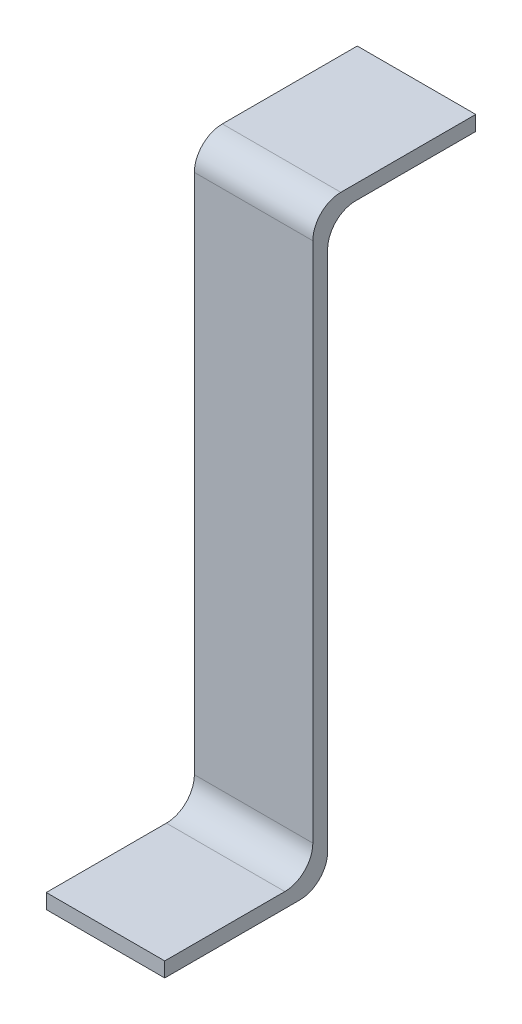
ISO-10303-21;
HEADER;
FILE_DESCRIPTION(('STEP AP214'),'2;1');
FILE_NAME('part.step','',(''),(''),'','','');
FILE_SCHEMA(('AUTOMOTIVE_DESIGN { 1 0 10303 214 1 1 1 1 }'));
ENDSEC;
DATA;
#1=APPLICATION_CONTEXT('core data for automotive mechanical design processes');
#2=APPLICATION_PROTOCOL_DEFINITION('international standard','automotive_design',2000,#1);
#3=PRODUCT_CONTEXT('',#1,'mechanical');
#4=PRODUCT('Part','Part','',(#3));
#5=PRODUCT_RELATED_PRODUCT_CATEGORY('part','',(#4));
#6=PRODUCT_DEFINITION_FORMATION('','',#4);
#7=PRODUCT_DEFINITION_CONTEXT('part definition',#1,'design');
#8=PRODUCT_DEFINITION('design','',#6,#7);
#9=PRODUCT_DEFINITION_SHAPE('','',#8);
#10=(LENGTH_UNIT() NAMED_UNIT(*) SI_UNIT(.MILLI.,.METRE.));
#11=(NAMED_UNIT(*) PLANE_ANGLE_UNIT() SI_UNIT($,.RADIAN.));
#12=(NAMED_UNIT(*) SI_UNIT($,.STERADIAN.) SOLID_ANGLE_UNIT());
#13=UNCERTAINTY_MEASURE_WITH_UNIT(LENGTH_MEASURE(1.E-05),#10,'distance_accuracy_value','');
#14=(GEOMETRIC_REPRESENTATION_CONTEXT(3) GLOBAL_UNCERTAINTY_ASSIGNED_CONTEXT((#13)) GLOBAL_UNIT_ASSIGNED_CONTEXT((#10,
#11,#12)) REPRESENTATION_CONTEXT('',''));
#15=CARTESIAN_POINT('',(0.,0.,0.));
#16=DIRECTION('',(0.,0.,1.));
#17=DIRECTION('',(1.,0.,0.));
#18=AXIS2_PLACEMENT_3D('',#15,#16,#17);
#19=CARTESIAN_POINT('',(12.7,63.5,-15.875));
#20=DIRECTION('',(0.,0.,1.));
#21=DIRECTION('',(1.,0.,0.));
#22=AXIS2_PLACEMENT_3D('',#19,#20,#21);
#23=PLANE('',#22);
#24=DIRECTION('',(0.,1.,0.));
#25=VECTOR('',#24,1.);
#26=CARTESIAN_POINT('',(0.,63.5,-15.875));
#27=LINE('',#26,#25);
#28=CARTESIAN_POINT('',(0.,61.9125,-15.875));
#29=VERTEX_POINT('',#28);
#30=CARTESIAN_POINT('',(0.,63.5,-15.875));
#31=VERTEX_POINT('',#30);
#32=EDGE_CURVE('E168',#29,#31,#27,.T.);
#33=ORIENTED_EDGE('',*,*,#32,.T.);
#34=DIRECTION('',(-1.,0.,0.));
#35=VECTOR('',#34,1.);
#36=CARTESIAN_POINT('',(12.7,63.5,-15.875));
#37=LINE('',#36,#35);
#38=CARTESIAN_POINT('',(12.7,63.5,-15.875));
#39=VERTEX_POINT('',#38);
#40=EDGE_CURVE('E11',#39,#31,#37,.T.);
#41=ORIENTED_EDGE('',*,*,#40,.F.);
#42=DIRECTION('',(0.,1.,0.));
#43=VECTOR('',#42,1.);
#44=CARTESIAN_POINT('',(12.7,63.5,-15.875));
#45=LINE('',#44,#43);
#46=CARTESIAN_POINT('',(12.7,61.9125,-15.875));
#47=VERTEX_POINT('',#46);
#48=EDGE_CURVE('E202',#47,#39,#45,.T.);
#49=ORIENTED_EDGE('',*,*,#48,.F.);
#50=DIRECTION('',(-1.,0.,0.));
#51=VECTOR('',#50,1.);
#52=CARTESIAN_POINT('',(12.7,61.9125,-15.875));
#53=LINE('',#52,#51);
#54=EDGE_CURVE('E164',#47,#29,#53,.T.);
#55=ORIENTED_EDGE('',*,*,#54,.T.);
#56=EDGE_LOOP('',(#33,#41,#49,#55));
#57=FACE_BOUND('',#56,.T.);
#58=ADVANCED_FACE('F43',(#57),#23,.F.);
#59=CARTESIAN_POINT('',(12.7,63.5,-1.41250000000001));
#60=DIRECTION('',(0.,-1.,0.));
#61=DIRECTION('',(0.,0.,-1.));
#62=AXIS2_PLACEMENT_3D('',#59,#60,#61);
#63=PLANE('',#62);
#64=DIRECTION('',(0.,0.,1.));
#65=VECTOR('',#64,1.);
#66=CARTESIAN_POINT('',(0.,63.5,-1.41250000000001));
#67=LINE('',#66,#65);
#68=CARTESIAN_POINT('',(0.,63.5,-1.41250000000001));
#69=VERTEX_POINT('',#68);
#70=EDGE_CURVE('E172',#31,#69,#67,.T.);
#71=ORIENTED_EDGE('',*,*,#70,.T.);
#72=DIRECTION('',(-1.,0.,0.));
#73=VECTOR('',#72,1.);
#74=CARTESIAN_POINT('',(12.7,63.5,-1.41250000000001));
#75=LINE('',#74,#73);
#76=CARTESIAN_POINT('',(12.7,63.5,-1.41250000000001));
#77=VERTEX_POINT('',#76);
#78=EDGE_CURVE('E52',#77,#69,#75,.T.);
#79=ORIENTED_EDGE('',*,*,#78,.F.);
#80=DIRECTION('',(0.,0.,1.));
#81=VECTOR('',#80,1.);
#82=CARTESIAN_POINT('',(12.7,63.5,-1.41250000000001));
#83=LINE('',#82,#81);
#84=EDGE_CURVE('E115',#39,#77,#83,.T.);
#85=ORIENTED_EDGE('',*,*,#84,.F.);
#86=ORIENTED_EDGE('',*,*,#40,.T.);
#87=EDGE_LOOP('',(#71,#79,#85,#86));
#88=FACE_BOUND('',#87,.T.);
#89=ADVANCED_FACE('F296',(#88),#63,.F.);
#90=CARTESIAN_POINT('',(12.7,60.5,-1.41250000000001));
#91=DIRECTION('',(-1.,0.,0.));
#92=DIRECTION('',(0.,0.,1.));
#93=AXIS2_PLACEMENT_3D('',#90,#91,#92);
#94=CYLINDRICAL_SURFACE('',#93,3.);
#95=CARTESIAN_POINT('',(0.,60.5,-1.41250000000001));
#96=DIRECTION('',(1.,0.,0.));
#97=DIRECTION('',(0.,0.,-1.));
#98=AXIS2_PLACEMENT_3D('',#95,#96,#97);
#99=CIRCLE('',#98,3.);
#100=CARTESIAN_POINT('',(0.,60.5,1.58749999999999));
#101=VERTEX_POINT('',#100);
#102=EDGE_CURVE('E175',#69,#101,#99,.T.);
#103=ORIENTED_EDGE('',*,*,#102,.T.);
#104=DIRECTION('',(-1.,0.,0.));
#105=VECTOR('',#104,1.);
#106=CARTESIAN_POINT('',(12.7,60.5,1.58749999999999));
#107=LINE('',#106,#105);
#108=CARTESIAN_POINT('',(12.7,60.5,1.58749999999999));
#109=VERTEX_POINT('',#108);
#110=EDGE_CURVE('E229',#109,#101,#107,.T.);
#111=ORIENTED_EDGE('',*,*,#110,.F.);
#112=CARTESIAN_POINT('',(12.7,60.5,-1.41250000000001));
#113=DIRECTION('',(1.,0.,0.));
#114=DIRECTION('',(0.,0.,-1.));
#115=AXIS2_PLACEMENT_3D('',#112,#113,#114);
#116=CIRCLE('',#115,3.);
#117=EDGE_CURVE('E239',#77,#109,#116,.T.);
#118=ORIENTED_EDGE('',*,*,#117,.F.);
#119=ORIENTED_EDGE('',*,*,#78,.T.);
#120=EDGE_LOOP('',(#103,#111,#118,#119));
#121=FACE_BOUND('',#120,.T.);
#122=ADVANCED_FACE('F237',(#121),#94,.T.);
#123=CARTESIAN_POINT('',(12.7,4.5875,1.58749999999999));
#124=DIRECTION('',(0.,0.,-1.));
#125=DIRECTION('',(-1.,0.,0.));
#126=AXIS2_PLACEMENT_3D('',#123,#124,#125);
#127=PLANE('',#126);
#128=DIRECTION('',(0.,-1.,0.));
#129=VECTOR('',#128,1.);
#130=CARTESIAN_POINT('',(0.,4.5875,1.58749999999999));
#131=LINE('',#130,#129);
#132=CARTESIAN_POINT('',(0.,4.5875,1.58749999999999));
#133=VERTEX_POINT('',#132);
#134=EDGE_CURVE('E178',#101,#133,#131,.T.);
#135=ORIENTED_EDGE('',*,*,#134,.T.);
#136=DIRECTION('',(-1.,0.,0.));
#137=VECTOR('',#136,1.);
#138=CARTESIAN_POINT('',(12.7,4.5875,1.58749999999999));
#139=LINE('',#138,#137);
#140=CARTESIAN_POINT('',(12.7,4.5875,1.58749999999999));
#141=VERTEX_POINT('',#140);
#142=EDGE_CURVE('E225',#141,#133,#139,.T.);
#143=ORIENTED_EDGE('',*,*,#142,.F.);
#144=DIRECTION('',(0.,-1.,0.));
#145=VECTOR('',#144,1.);
#146=CARTESIAN_POINT('',(12.7,4.5875,1.58749999999999));
#147=LINE('',#146,#145);
#148=EDGE_CURVE('E258',#109,#141,#147,.T.);
#149=ORIENTED_EDGE('',*,*,#148,.F.);
#150=ORIENTED_EDGE('',*,*,#110,.T.);
#151=EDGE_LOOP('',(#135,#143,#149,#150));
#152=FACE_BOUND('',#151,.T.);
#153=ADVANCED_FACE('F248',(#152),#127,.F.);
#154=CARTESIAN_POINT('',(12.7,4.5875,4.58749999999999));
#155=DIRECTION('',(-1.,0.,0.));
#156=DIRECTION('',(0.,0.,1.));
#157=AXIS2_PLACEMENT_3D('',#154,#155,#156);
#158=CYLINDRICAL_SURFACE('',#157,3.);
#159=CARTESIAN_POINT('',(0.,4.5875,4.58749999999999));
#160=DIRECTION('',(-1.,0.,0.));
#161=DIRECTION('',(0.,0.,-1.));
#162=AXIS2_PLACEMENT_3D('',#159,#160,#161);
#163=CIRCLE('',#162,3.);
#164=CARTESIAN_POINT('',(0.,1.5875,4.5875));
#165=VERTEX_POINT('',#164);
#166=EDGE_CURVE('E181',#133,#165,#163,.T.);
#167=ORIENTED_EDGE('',*,*,#166,.T.);
#168=DIRECTION('',(-1.,0.,0.));
#169=VECTOR('',#168,1.);
#170=CARTESIAN_POINT('',(12.7,1.5875,4.5875));
#171=LINE('',#170,#169);
#172=CARTESIAN_POINT('',(12.7,1.5875,4.5875));
#173=VERTEX_POINT('',#172);
#174=EDGE_CURVE('E221',#173,#165,#171,.T.);
#175=ORIENTED_EDGE('',*,*,#174,.F.);
#176=CARTESIAN_POINT('',(12.7,4.5875,4.58749999999999));
#177=DIRECTION('',(-1.,0.,0.));
#178=DIRECTION('',(0.,0.,-1.));
#179=AXIS2_PLACEMENT_3D('',#176,#177,#178);
#180=CIRCLE('',#179,3.);
#181=EDGE_CURVE('E254',#141,#173,#180,.T.);
#182=ORIENTED_EDGE('',*,*,#181,.F.);
#183=ORIENTED_EDGE('',*,*,#142,.T.);
#184=EDGE_LOOP('',(#167,#175,#182,#183));
#185=FACE_BOUND('',#184,.T.);
#186=ADVANCED_FACE('F252',(#185),#158,.F.);
#187=CARTESIAN_POINT('',(12.7,1.5875,17.4625));
#188=DIRECTION('',(0.,-1.,0.));
#189=DIRECTION('',(0.,0.,-1.));
#190=AXIS2_PLACEMENT_3D('',#187,#188,#189);
#191=PLANE('',#190);
#192=DIRECTION('',(0.,0.,1.));
#193=VECTOR('',#192,1.);
#194=CARTESIAN_POINT('',(0.,1.5875,17.4625));
#195=LINE('',#194,#193);
#196=CARTESIAN_POINT('',(0.,1.5875,17.4625));
#197=VERTEX_POINT('',#196);
#198=EDGE_CURVE('E184',#165,#197,#195,.T.);
#199=ORIENTED_EDGE('',*,*,#198,.T.);
#200=DIRECTION('',(-1.,0.,0.));
#201=VECTOR('',#200,1.);
#202=CARTESIAN_POINT('',(12.7,1.5875,17.4625));
#203=LINE('',#202,#201);
#204=CARTESIAN_POINT('',(12.7,1.5875,17.4625));
#205=VERTEX_POINT('',#204);
#206=EDGE_CURVE('E217',#205,#197,#203,.T.);
#207=ORIENTED_EDGE('',*,*,#206,.F.);
#208=DIRECTION('',(0.,0.,1.));
#209=VECTOR('',#208,1.);
#210=CARTESIAN_POINT('',(12.7,1.5875,17.4625));
#211=LINE('',#210,#209);
#212=EDGE_CURVE('E257',#173,#205,#211,.T.);
#213=ORIENTED_EDGE('',*,*,#212,.F.);
#214=ORIENTED_EDGE('',*,*,#174,.T.);
#215=EDGE_LOOP('',(#199,#207,#213,#214));
#216=FACE_BOUND('',#215,.T.);
#217=ADVANCED_FACE('F309',(#216),#191,.F.);
#218=CARTESIAN_POINT('',(12.7,0.,17.4625));
#219=DIRECTION('',(0.,0.,-1.));
#220=DIRECTION('',(-1.,0.,0.));
#221=AXIS2_PLACEMENT_3D('',#218,#219,#220);
#222=PLANE('',#221);
#223=DIRECTION('',(0.,-1.,0.));
#224=VECTOR('',#223,1.);
#225=CARTESIAN_POINT('',(0.,0.,17.4625));
#226=LINE('',#225,#224);
#227=CARTESIAN_POINT('',(0.,0.,17.4625));
#228=VERTEX_POINT('',#227);
#229=EDGE_CURVE('E187',#197,#228,#226,.T.);
#230=ORIENTED_EDGE('',*,*,#229,.T.);
#231=DIRECTION('',(-1.,0.,0.));
#232=VECTOR('',#231,1.);
#233=CARTESIAN_POINT('',(12.7,0.,17.4625));
#234=LINE('',#233,#232);
#235=CARTESIAN_POINT('',(12.7,0.,17.4625));
#236=VERTEX_POINT('',#235);
#237=EDGE_CURVE('E213',#236,#228,#234,.T.);
#238=ORIENTED_EDGE('',*,*,#237,.F.);
#239=DIRECTION('',(0.,-1.,0.));
#240=VECTOR('',#239,1.);
#241=CARTESIAN_POINT('',(12.7,0.,17.4625));
#242=LINE('',#241,#240);
#243=EDGE_CURVE('E262',#205,#236,#242,.T.);
#244=ORIENTED_EDGE('',*,*,#243,.F.);
#245=ORIENTED_EDGE('',*,*,#206,.T.);
#246=EDGE_LOOP('',(#230,#238,#244,#245));
#247=FACE_BOUND('',#246,.T.);
#248=ADVANCED_FACE('F312',(#247),#222,.F.);
#249=CARTESIAN_POINT('',(12.7,0.,2.99999999999999));
#250=DIRECTION('',(0.,1.,0.));
#251=DIRECTION('',(0.,0.,1.));
#252=AXIS2_PLACEMENT_3D('',#249,#250,#251);
#253=PLANE('',#252);
#254=DIRECTION('',(0.,0.,-1.));
#255=VECTOR('',#254,1.);
#256=CARTESIAN_POINT('',(0.,0.,2.99999999999999));
#257=LINE('',#256,#255);
#258=CARTESIAN_POINT('',(0.,0.,2.99999999999999));
#259=VERTEX_POINT('',#258);
#260=EDGE_CURVE('E190',#228,#259,#257,.T.);
#261=ORIENTED_EDGE('',*,*,#260,.T.);
#262=DIRECTION('',(-1.,0.,0.));
#263=VECTOR('',#262,1.);
#264=CARTESIAN_POINT('',(12.7,0.,2.99999999999999));
#265=LINE('',#264,#263);
#266=CARTESIAN_POINT('',(12.7,0.,2.99999999999999));
#267=VERTEX_POINT('',#266);
#268=EDGE_CURVE('E209',#267,#259,#265,.T.);
#269=ORIENTED_EDGE('',*,*,#268,.F.);
#270=DIRECTION('',(0.,0.,-1.));
#271=VECTOR('',#270,1.);
#272=CARTESIAN_POINT('',(12.7,0.,2.99999999999999));
#273=LINE('',#272,#271);
#274=EDGE_CURVE('E269',#236,#267,#273,.T.);
#275=ORIENTED_EDGE('',*,*,#274,.F.);
#276=ORIENTED_EDGE('',*,*,#237,.T.);
#277=EDGE_LOOP('',(#261,#269,#275,#276));
#278=FACE_BOUND('',#277,.T.);
#279=ADVANCED_FACE('F277',(#278),#253,.F.);
#280=CARTESIAN_POINT('',(12.7,3.,2.99999999999999));
#281=DIRECTION('',(-1.,0.,0.));
#282=DIRECTION('',(0.,0.,1.));
#283=AXIS2_PLACEMENT_3D('',#280,#281,#282);
#284=CYLINDRICAL_SURFACE('',#283,3.);
#285=CARTESIAN_POINT('',(0.,3.,2.99999999999999));
#286=DIRECTION('',(1.,0.,0.));
#287=DIRECTION('',(0.,0.,1.));
#288=AXIS2_PLACEMENT_3D('',#285,#286,#287);
#289=CIRCLE('',#288,3.);
#290=CARTESIAN_POINT('',(0.,3.,0.));
#291=VERTEX_POINT('',#290);
#292=EDGE_CURVE('E193',#259,#291,#289,.T.);
#293=ORIENTED_EDGE('',*,*,#292,.T.);
#294=DIRECTION('',(-1.,0.,0.));
#295=VECTOR('',#294,1.);
#296=CARTESIAN_POINT('',(12.7,3.,0.));
#297=LINE('',#296,#295);
#298=CARTESIAN_POINT('',(12.7,3.,0.));
#299=VERTEX_POINT('',#298);
#300=EDGE_CURVE('E157',#299,#291,#297,.T.);
#301=ORIENTED_EDGE('',*,*,#300,.F.);
#302=CARTESIAN_POINT('',(12.7,3.,2.99999999999999));
#303=DIRECTION('',(1.,0.,0.));
#304=DIRECTION('',(0.,0.,1.));
#305=AXIS2_PLACEMENT_3D('',#302,#303,#304);
#306=CIRCLE('',#305,3.);
#307=EDGE_CURVE('E146',#267,#299,#306,.T.);
#308=ORIENTED_EDGE('',*,*,#307,.F.);
#309=ORIENTED_EDGE('',*,*,#268,.T.);
#310=EDGE_LOOP('',(#293,#301,#308,#309));
#311=FACE_BOUND('',#310,.T.);
#312=ADVANCED_FACE('F281',(#311),#284,.T.);
#313=CARTESIAN_POINT('',(12.7,58.9125,0.));
#314=DIRECTION('',(0.,0.,1.));
#315=DIRECTION('',(0.,-1.,0.));
#316=AXIS2_PLACEMENT_3D('',#313,#314,#315);
#317=PLANE('',#316);
#318=DIRECTION('',(0.,1.,0.));
#319=VECTOR('',#318,1.);
#320=CARTESIAN_POINT('',(0.,58.9125,0.));
#321=LINE('',#320,#319);
#322=CARTESIAN_POINT('',(0.,58.9125,0.));
#323=VERTEX_POINT('',#322);
#324=EDGE_CURVE('E155',#291,#323,#321,.T.);
#325=ORIENTED_EDGE('',*,*,#324,.T.);
#326=DIRECTION('',(-1.,0.,0.));
#327=VECTOR('',#326,1.);
#328=CARTESIAN_POINT('',(12.7,58.9125,0.));
#329=LINE('',#328,#327);
#330=CARTESIAN_POINT('',(12.7,58.9125,0.));
#331=VERTEX_POINT('',#330);
#332=EDGE_CURVE('E152',#331,#323,#329,.T.);
#333=ORIENTED_EDGE('',*,*,#332,.F.);
#334=DIRECTION('',(0.,1.,0.));
#335=VECTOR('',#334,1.);
#336=CARTESIAN_POINT('',(12.7,58.9125,0.));
#337=LINE('',#336,#335);
#338=EDGE_CURVE('E140',#299,#331,#337,.T.);
#339=ORIENTED_EDGE('',*,*,#338,.F.);
#340=ORIENTED_EDGE('',*,*,#300,.T.);
#341=EDGE_LOOP('',(#325,#333,#339,#340));
#342=FACE_BOUND('',#341,.T.);
#343=ADVANCED_FACE('F153',(#342),#317,.F.);
#344=CARTESIAN_POINT('',(12.7,58.9125,-3.));
#345=DIRECTION('',(-1.,0.,0.));
#346=DIRECTION('',(0.,0.,1.));
#347=AXIS2_PLACEMENT_3D('',#344,#345,#346);
#348=CYLINDRICAL_SURFACE('',#347,3.);
#349=CARTESIAN_POINT('',(0.,58.9125,-3.));
#350=DIRECTION('',(-1.,0.,0.));
#351=DIRECTION('',(0.,0.,-1.));
#352=AXIS2_PLACEMENT_3D('',#349,#350,#351);
#353=CIRCLE('',#352,3.);
#354=CARTESIAN_POINT('',(0.,61.9125,-3.));
#355=VERTEX_POINT('',#354);
#356=EDGE_CURVE('E101',#323,#355,#353,.T.);
#357=ORIENTED_EDGE('',*,*,#356,.T.);
#358=DIRECTION('',(-1.,0.,0.));
#359=VECTOR('',#358,1.);
#360=CARTESIAN_POINT('',(12.7,61.9125,-3.));
#361=LINE('',#360,#359);
#362=CARTESIAN_POINT('',(12.7,61.9125,-3.));
#363=VERTEX_POINT('',#362);
#364=EDGE_CURVE('E158',#363,#355,#361,.T.);
#365=ORIENTED_EDGE('',*,*,#364,.F.);
#366=CARTESIAN_POINT('',(12.7,58.9125,-3.));
#367=DIRECTION('',(-1.,0.,0.));
#368=DIRECTION('',(0.,0.,-1.));
#369=AXIS2_PLACEMENT_3D('',#366,#367,#368);
#370=CIRCLE('',#369,3.);
#371=EDGE_CURVE('E144',#331,#363,#370,.T.);
#372=ORIENTED_EDGE('',*,*,#371,.F.);
#373=ORIENTED_EDGE('',*,*,#332,.T.);
#374=EDGE_LOOP('',(#357,#365,#372,#373));
#375=FACE_BOUND('',#374,.T.);
#376=ADVANCED_FACE('F160',(#375),#348,.F.);
#377=CARTESIAN_POINT('',(12.7,61.9125,-15.875));
#378=DIRECTION('',(0.,1.,0.));
#379=DIRECTION('',(0.,0.,1.));
#380=AXIS2_PLACEMENT_3D('',#377,#378,#379);
#381=PLANE('',#380);
#382=DIRECTION('',(0.,0.,-1.));
#383=VECTOR('',#382,1.);
#384=CARTESIAN_POINT('',(0.,61.9125,-15.875));
#385=LINE('',#384,#383);
#386=EDGE_CURVE('E107',#355,#29,#385,.T.);
#387=ORIENTED_EDGE('',*,*,#386,.T.);
#388=ORIENTED_EDGE('',*,*,#54,.F.);
#389=DIRECTION('',(0.,0.,-1.));
#390=VECTOR('',#389,1.);
#391=CARTESIAN_POINT('',(12.7,61.9125,-15.875));
#392=LINE('',#391,#390);
#393=EDGE_CURVE('E60',#363,#47,#392,.T.);
#394=ORIENTED_EDGE('',*,*,#393,.F.);
#395=ORIENTED_EDGE('',*,*,#364,.T.);
#396=EDGE_LOOP('',(#387,#388,#394,#395));
#397=FACE_BOUND('',#396,.T.);
#398=ADVANCED_FACE('F285',(#397),#381,.F.);
#399=CARTESIAN_POINT('',(12.7,58.9125,-3.));
#400=DIRECTION('',(1.,0.,0.));
#401=DIRECTION('',(0.,0.,-1.));
#402=AXIS2_PLACEMENT_3D('',#399,#400,#401);
#403=PLANE('',#402);
#404=ORIENTED_EDGE('',*,*,#48,.T.);
#405=ORIENTED_EDGE('',*,*,#84,.T.);
#406=ORIENTED_EDGE('',*,*,#117,.T.);
#407=ORIENTED_EDGE('',*,*,#148,.T.);
#408=ORIENTED_EDGE('',*,*,#181,.T.);
#409=ORIENTED_EDGE('',*,*,#212,.T.);
#410=ORIENTED_EDGE('',*,*,#243,.T.);
#411=ORIENTED_EDGE('',*,*,#274,.T.);
#412=ORIENTED_EDGE('',*,*,#307,.T.);
#413=ORIENTED_EDGE('',*,*,#338,.T.);
#414=ORIENTED_EDGE('',*,*,#371,.T.);
#415=ORIENTED_EDGE('',*,*,#393,.T.);
#416=EDGE_LOOP('',(#404,#405,#406,#407,#408,#409,#410,#411,#412,#413,#414,#415));
#417=FACE_BOUND('',#416,.T.);
#418=ADVANCED_FACE('F142',(#417),#403,.T.);
#419=CARTESIAN_POINT('',(0.,58.9125,-3.));
#420=DIRECTION('',(1.,0.,0.));
#421=DIRECTION('',(0.,0.,-1.));
#422=AXIS2_PLACEMENT_3D('',#419,#420,#421);
#423=PLANE('',#422);
#424=ORIENTED_EDGE('',*,*,#32,.F.);
#425=ORIENTED_EDGE('',*,*,#386,.F.);
#426=ORIENTED_EDGE('',*,*,#356,.F.);
#427=ORIENTED_EDGE('',*,*,#324,.F.);
#428=ORIENTED_EDGE('',*,*,#292,.F.);
#429=ORIENTED_EDGE('',*,*,#260,.F.);
#430=ORIENTED_EDGE('',*,*,#229,.F.);
#431=ORIENTED_EDGE('',*,*,#198,.F.);
#432=ORIENTED_EDGE('',*,*,#166,.F.);
#433=ORIENTED_EDGE('',*,*,#134,.F.);
#434=ORIENTED_EDGE('',*,*,#102,.F.);
#435=ORIENTED_EDGE('',*,*,#70,.F.);
#436=EDGE_LOOP('',(#424,#425,#426,#427,#428,#429,#430,#431,#432,#433,#434,#435));
#437=FACE_BOUND('',#436,.T.);
#438=ADVANCED_FACE('F243',(#437),#423,.F.);
#439=CLOSED_SHELL('',(#58,#89,#122,#153,#186,#217,#248,#279,#312,#343,#376,#398,#418,#438));
#440=MANIFOLD_SOLID_BREP('B2',#439);
#441=ADVANCED_BREP_SHAPE_REPRESENTATION('',(#18,#440),#14);
#442=SHAPE_DEFINITION_REPRESENTATION(#9,#441);
ENDSEC;
END-ISO-10303-21;
